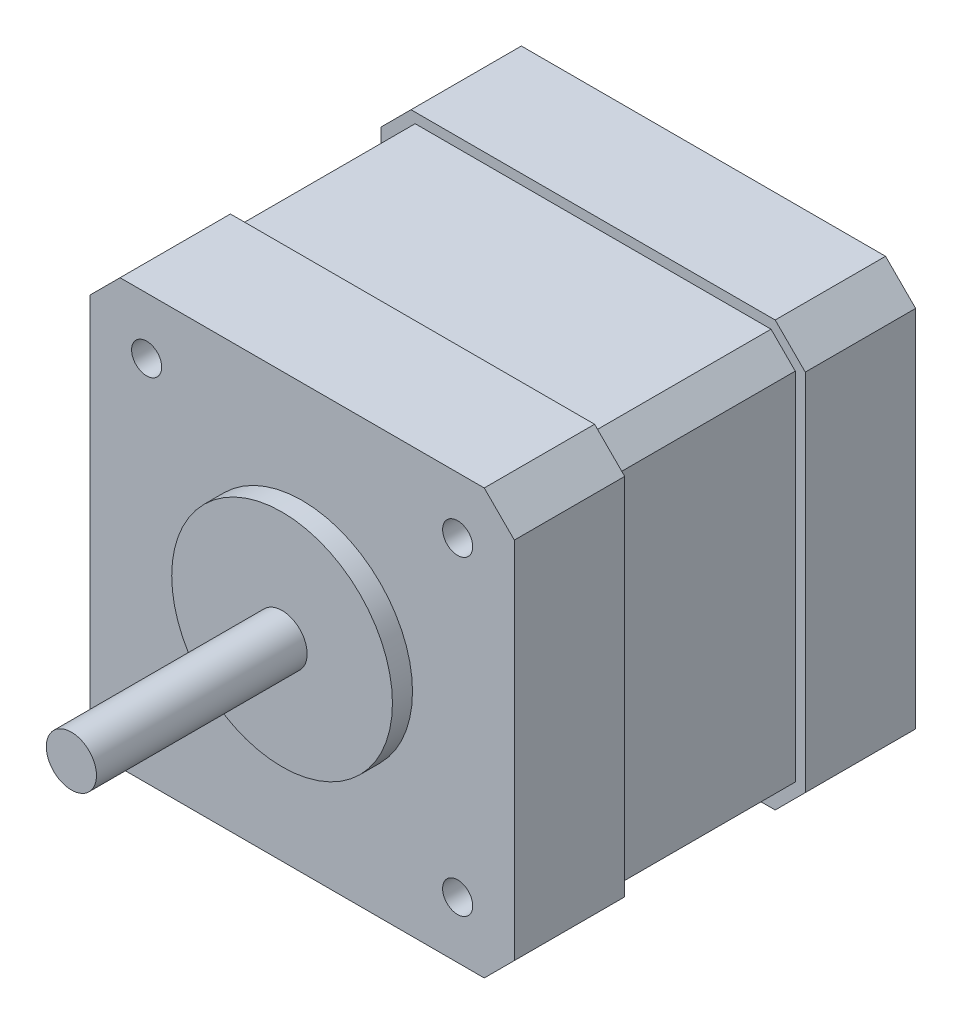
ISO-10303-21;
HEADER;
FILE_DESCRIPTION(('STEP AP214'),'2;1');
FILE_NAME('part.step','',(''),(''),'','','');
FILE_SCHEMA(('AUTOMOTIVE_DESIGN { 1 0 10303 214 1 1 1 1 }'));
ENDSEC;
DATA;
#1=APPLICATION_CONTEXT('core data for automotive mechanical design processes');
#2=APPLICATION_PROTOCOL_DEFINITION('international standard','automotive_design',2000,#1);
#3=PRODUCT_CONTEXT('',#1,'mechanical');
#4=PRODUCT('Part','Part','',(#3));
#5=PRODUCT_RELATED_PRODUCT_CATEGORY('part','',(#4));
#6=PRODUCT_DEFINITION_FORMATION('','',#4);
#7=PRODUCT_DEFINITION_CONTEXT('part definition',#1,'design');
#8=PRODUCT_DEFINITION('design','',#6,#7);
#9=PRODUCT_DEFINITION_SHAPE('','',#8);
#10=(LENGTH_UNIT() NAMED_UNIT(*) SI_UNIT(.MILLI.,.METRE.));
#11=(NAMED_UNIT(*) PLANE_ANGLE_UNIT() SI_UNIT($,.RADIAN.));
#12=(NAMED_UNIT(*) SI_UNIT($,.STERADIAN.) SOLID_ANGLE_UNIT());
#13=UNCERTAINTY_MEASURE_WITH_UNIT(LENGTH_MEASURE(1.E-05),#10,'distance_accuracy_value','');
#14=(GEOMETRIC_REPRESENTATION_CONTEXT(3) GLOBAL_UNCERTAINTY_ASSIGNED_CONTEXT((#13)) GLOBAL_UNIT_ASSIGNED_CONTEXT((#10,
#11,#12)) REPRESENTATION_CONTEXT('',''));
#15=CARTESIAN_POINT('',(0.,0.,0.));
#16=DIRECTION('',(0.,0.,1.));
#17=DIRECTION('',(1.,0.,0.));
#18=AXIS2_PLACEMENT_3D('',#15,#16,#17);
#19=CARTESIAN_POINT('',(-11.6177538051841,1.61380510440835,12.));
#20=DIRECTION('',(0.,0.,-1.));
#21=DIRECTION('',(-1.,0.,0.));
#22=AXIS2_PLACEMENT_3D('',#19,#20,#21);
#23=CYLINDRICAL_SURFACE('',#22,11.);
#24=CARTESIAN_POINT('',(-11.6177538051841,1.61380510440835,11.));
#25=DIRECTION('',(0.,0.,1.));
#26=DIRECTION('',(1.,0.,0.));
#27=AXIS2_PLACEMENT_3D('',#24,#25,#26);
#28=CIRCLE('',#27,11.);
#29=CARTESIAN_POINT('',(-0.617753805184125,1.61380510440835,11.));
#30=VERTEX_POINT('',#29);
#31=EDGE_CURVE('E43',#30,#30,#28,.T.);
#32=ORIENTED_EDGE('',*,*,#31,.T.);
#33=EDGE_LOOP('',(#32));
#34=FACE_BOUND('',#33,.T.);
#35=CARTESIAN_POINT('',(-11.6177538051841,1.61380510440835,13.));
#36=DIRECTION('',(0.,0.,1.));
#37=DIRECTION('',(1.,0.,0.));
#38=AXIS2_PLACEMENT_3D('',#35,#36,#37);
#39=CIRCLE('',#38,11.);
#40=CARTESIAN_POINT('',(-0.617753805184125,1.61380510440835,13.));
#41=VERTEX_POINT('',#40);
#42=EDGE_CURVE('E915',#41,#41,#39,.T.);
#43=ORIENTED_EDGE('',*,*,#42,.F.);
#44=EDGE_LOOP('',(#43));
#45=FACE_BOUND('',#44,.T.);
#46=ADVANCED_FACE('F39',(#34,#45),#23,.T.);
#47=CARTESIAN_POINT('',(0.,0.,11.));
#48=DIRECTION('',(0.,0.,1.));
#49=DIRECTION('',(1.,0.,0.));
#50=AXIS2_PLACEMENT_3D('',#47,#48,#49);
#51=PLANE('',#50);
#52=ORIENTED_EDGE('',*,*,#31,.F.);
#53=EDGE_LOOP('',(#52));
#54=FACE_BOUND('',#53,.T.);
#55=CARTESIAN_POINT('',(-27.1177538051841,-13.8861948955917,11.));
#56=DIRECTION('',(0.,0.,1.));
#57=DIRECTION('',(1.,0.,0.));
#58=AXIS2_PLACEMENT_3D('',#55,#56,#57);
#59=CIRCLE('',#58,1.5);
#60=CARTESIAN_POINT('',(-25.6177538051841,-13.8861948955917,11.));
#61=VERTEX_POINT('',#60);
#62=EDGE_CURVE('E253',#61,#61,#59,.T.);
#63=ORIENTED_EDGE('',*,*,#62,.F.);
#64=EDGE_LOOP('',(#63));
#65=FACE_BOUND('',#64,.T.);
#66=CARTESIAN_POINT('',(3.88224619481587,17.1138051044083,11.));
#67=DIRECTION('',(0.,0.,1.));
#68=DIRECTION('',(1.,0.,0.));
#69=AXIS2_PLACEMENT_3D('',#66,#67,#68);
#70=CIRCLE('',#69,1.5);
#71=CARTESIAN_POINT('',(5.38224619481587,17.1138051044083,11.));
#72=VERTEX_POINT('',#71);
#73=EDGE_CURVE('E259',#72,#72,#70,.T.);
#74=ORIENTED_EDGE('',*,*,#73,.F.);
#75=EDGE_LOOP('',(#74));
#76=FACE_BOUND('',#75,.T.);
#77=DIRECTION('',(-1.,0.,0.));
#78=VECTOR('',#77,1.);
#79=CARTESIAN_POINT('',(6.53224619481587,22.7638051044083,11.));
#80=LINE('',#79,#78);
#81=CARTESIAN_POINT('',(6.53224619481587,22.7638051044083,11.));
#82=VERTEX_POINT('',#81);
#83=CARTESIAN_POINT('',(-29.7677538051841,22.7638051044083,11.));
#84=VERTEX_POINT('',#83);
#85=EDGE_CURVE('E262',#82,#84,#80,.T.);
#86=ORIENTED_EDGE('',*,*,#85,.T.);
#87=DIRECTION('',(-0.707106781186548,-0.707106781186548,0.));
#88=VECTOR('',#87,1.);
#89=CARTESIAN_POINT('',(-29.7677538051841,22.7638051044083,11.));
#90=LINE('',#89,#88);
#91=CARTESIAN_POINT('',(-32.7677538051841,19.7638051044083,11.));
#92=VERTEX_POINT('',#91);
#93=EDGE_CURVE('E265',#84,#92,#90,.T.);
#94=ORIENTED_EDGE('',*,*,#93,.T.);
#95=DIRECTION('',(0.,-1.,0.));
#96=VECTOR('',#95,1.);
#97=CARTESIAN_POINT('',(-32.7677538051841,19.7638051044083,11.));
#98=LINE('',#97,#96);
#99=CARTESIAN_POINT('',(-32.7677538051841,-16.5361948955916,11.));
#100=VERTEX_POINT('',#99);
#101=EDGE_CURVE('E268',#92,#100,#98,.T.);
#102=ORIENTED_EDGE('',*,*,#101,.T.);
#103=DIRECTION('',(0.707106781186548,-0.707106781186548,0.));
#104=VECTOR('',#103,1.);
#105=CARTESIAN_POINT('',(-32.7677538051841,-16.5361948955916,11.));
#106=LINE('',#105,#104);
#107=CARTESIAN_POINT('',(-29.7677538051841,-19.5361948955916,11.));
#108=VERTEX_POINT('',#107);
#109=EDGE_CURVE('E271',#100,#108,#106,.T.);
#110=ORIENTED_EDGE('',*,*,#109,.T.);
#111=DIRECTION('',(1.,0.,0.));
#112=VECTOR('',#111,1.);
#113=CARTESIAN_POINT('',(-29.7677538051841,-19.5361948955916,11.));
#114=LINE('',#113,#112);
#115=CARTESIAN_POINT('',(6.53224619481587,-19.5361948955916,11.));
#116=VERTEX_POINT('',#115);
#117=EDGE_CURVE('E274',#108,#116,#114,.T.);
#118=ORIENTED_EDGE('',*,*,#117,.T.);
#119=DIRECTION('',(0.707106781186548,0.707106781186547,0.));
#120=VECTOR('',#119,1.);
#121=CARTESIAN_POINT('',(6.53224619481587,-19.5361948955916,11.));
#122=LINE('',#121,#120);
#123=CARTESIAN_POINT('',(9.53224619481587,-16.5361948955916,11.));
#124=VERTEX_POINT('',#123);
#125=EDGE_CURVE('E277',#116,#124,#122,.T.);
#126=ORIENTED_EDGE('',*,*,#125,.T.);
#127=DIRECTION('',(0.,1.,0.));
#128=VECTOR('',#127,1.);
#129=CARTESIAN_POINT('',(9.53224619481587,-16.5361948955916,11.));
#130=LINE('',#129,#128);
#131=CARTESIAN_POINT('',(9.53224619481587,19.7638051044083,11.));
#132=VERTEX_POINT('',#131);
#133=EDGE_CURVE('E280',#124,#132,#130,.T.);
#134=ORIENTED_EDGE('',*,*,#133,.T.);
#135=DIRECTION('',(-0.707106781186548,0.707106781186547,0.));
#136=VECTOR('',#135,1.);
#137=CARTESIAN_POINT('',(9.53224619481587,19.7638051044083,11.));
#138=LINE('',#137,#136);
#139=EDGE_CURVE('E283',#132,#82,#138,.T.);
#140=ORIENTED_EDGE('',*,*,#139,.T.);
#141=EDGE_LOOP('',(#86,#94,#102,#110,#118,#126,#134,#140));
#142=FACE_BOUND('',#141,.T.);
#143=CARTESIAN_POINT('',(3.88224619481587,-13.8861948955917,11.));
#144=DIRECTION('',(0.,0.,1.));
#145=DIRECTION('',(1.,0.,0.));
#146=AXIS2_PLACEMENT_3D('',#143,#144,#145);
#147=CIRCLE('',#146,1.5);
#148=CARTESIAN_POINT('',(5.38224619481587,-13.8861948955917,11.));
#149=VERTEX_POINT('',#148);
#150=EDGE_CURVE('E256',#149,#149,#147,.T.);
#151=ORIENTED_EDGE('',*,*,#150,.F.);
#152=EDGE_LOOP('',(#151));
#153=FACE_BOUND('',#152,.T.);
#154=CARTESIAN_POINT('',(-27.1177538051841,17.1138051044083,11.));
#155=DIRECTION('',(0.,0.,1.));
#156=DIRECTION('',(1.,0.,0.));
#157=AXIS2_PLACEMENT_3D('',#154,#155,#156);
#158=CIRCLE('',#157,1.5);
#159=CARTESIAN_POINT('',(-25.6177538051841,17.1138051044083,11.));
#160=VERTEX_POINT('',#159);
#161=EDGE_CURVE('E250',#160,#160,#158,.T.);
#162=ORIENTED_EDGE('',*,*,#161,.F.);
#163=EDGE_LOOP('',(#162));
#164=FACE_BOUND('',#163,.T.);
#165=ADVANCED_FACE('F440',(#54,#65,#76,#142,#153,#164),#51,.T.);
#166=CARTESIAN_POINT('',(8.53224619481587,19.3495915420353,-18.));
#167=DIRECTION('',(-1.,0.,0.));
#168=DIRECTION('',(0.,0.,1.));
#169=AXIS2_PLACEMENT_3D('',#166,#167,#168);
#170=PLANE('',#169);
#171=DIRECTION('',(0.,-1.,0.));
#172=VECTOR('',#171,1.);
#173=CARTESIAN_POINT('',(8.53224619481587,19.3495915420353,0.));
#174=LINE('',#173,#172);
#175=CARTESIAN_POINT('',(8.53224619481587,19.3495915420353,0.));
#176=VERTEX_POINT('',#175);
#177=CARTESIAN_POINT('',(8.53224619481587,-16.1219813332186,0.));
#178=VERTEX_POINT('',#177);
#179=EDGE_CURVE('E351',#176,#178,#174,.T.);
#180=ORIENTED_EDGE('',*,*,#179,.T.);
#181=DIRECTION('',(0.,0.,1.));
#182=VECTOR('',#181,1.);
#183=CARTESIAN_POINT('',(8.53224619481587,-16.1219813332186,-18.));
#184=LINE('',#183,#182);
#185=CARTESIAN_POINT('',(8.53224619481587,-16.1219813332186,-18.));
#186=VERTEX_POINT('',#185);
#187=EDGE_CURVE('E374',#186,#178,#184,.T.);
#188=ORIENTED_EDGE('',*,*,#187,.F.);
#189=DIRECTION('',(0.,-1.,0.));
#190=VECTOR('',#189,1.);
#191=CARTESIAN_POINT('',(8.53224619481587,19.3495915420353,-18.));
#192=LINE('',#191,#190);
#193=CARTESIAN_POINT('',(8.53224619481587,19.3495915420353,-18.));
#194=VERTEX_POINT('',#193);
#195=EDGE_CURVE('E329',#194,#186,#192,.T.);
#196=ORIENTED_EDGE('',*,*,#195,.F.);
#197=DIRECTION('',(0.,0.,1.));
#198=VECTOR('',#197,1.);
#199=CARTESIAN_POINT('',(8.53224619481587,19.3495915420353,-18.));
#200=LINE('',#199,#198);
#201=EDGE_CURVE('E377',#194,#176,#200,.T.);
#202=ORIENTED_EDGE('',*,*,#201,.T.);
#203=EDGE_LOOP('',(#180,#188,#196,#202));
#204=FACE_BOUND('',#203,.T.);
#205=ADVANCED_FACE('F466',(#204),#170,.F.);
#206=CARTESIAN_POINT('',(8.53224619481587,-16.1219813332186,-18.));
#207=DIRECTION('',(-0.707106781186547,0.707106781186547,0.));
#208=DIRECTION('',(-0.707106781186548,-0.707106781186548,0.));
#209=AXIS2_PLACEMENT_3D('',#206,#207,#208);
#210=PLANE('',#209);
#211=DIRECTION('',(-0.707106781186547,-0.707106781186547,0.));
#212=VECTOR('',#211,1.);
#213=CARTESIAN_POINT('',(8.53224619481587,-16.1219813332186,0.));
#214=LINE('',#213,#212);
#215=CARTESIAN_POINT('',(6.11803263244278,-18.5361948955916,0.));
#216=VERTEX_POINT('',#215);
#217=EDGE_CURVE('E353',#178,#216,#214,.T.);
#218=ORIENTED_EDGE('',*,*,#217,.T.);
#219=DIRECTION('',(0.,0.,1.));
#220=VECTOR('',#219,1.);
#221=CARTESIAN_POINT('',(6.11803263244278,-18.5361948955916,-18.));
#222=LINE('',#221,#220);
#223=CARTESIAN_POINT('',(6.11803263244278,-18.5361948955916,-18.));
#224=VERTEX_POINT('',#223);
#225=EDGE_CURVE('E371',#224,#216,#222,.T.);
#226=ORIENTED_EDGE('',*,*,#225,.F.);
#227=DIRECTION('',(-0.707106781186547,-0.707106781186547,0.));
#228=VECTOR('',#227,1.);
#229=CARTESIAN_POINT('',(8.53224619481587,-16.1219813332186,-18.));
#230=LINE('',#229,#228);
#231=EDGE_CURVE('E332',#186,#224,#230,.T.);
#232=ORIENTED_EDGE('',*,*,#231,.F.);
#233=ORIENTED_EDGE('',*,*,#187,.T.);
#234=EDGE_LOOP('',(#218,#226,#232,#233));
#235=FACE_BOUND('',#234,.T.);
#236=ADVANCED_FACE('F730',(#235),#210,.F.);
#237=CARTESIAN_POINT('',(6.11803263244278,-18.5361948955916,-18.));
#238=DIRECTION('',(0.,1.,0.));
#239=DIRECTION('',(-1.,0.,0.));
#240=AXIS2_PLACEMENT_3D('',#237,#238,#239);
#241=PLANE('',#240);
#242=DIRECTION('',(-1.,0.,0.));
#243=VECTOR('',#242,1.);
#244=CARTESIAN_POINT('',(6.11803263244278,-18.5361948955916,0.));
#245=LINE('',#244,#243);
#246=CARTESIAN_POINT('',(-29.353540242811,-18.5361948955917,0.));
#247=VERTEX_POINT('',#246);
#248=EDGE_CURVE('E355',#216,#247,#245,.T.);
#249=ORIENTED_EDGE('',*,*,#248,.T.);
#250=DIRECTION('',(0.,0.,1.));
#251=VECTOR('',#250,1.);
#252=CARTESIAN_POINT('',(-29.353540242811,-18.5361948955917,-18.));
#253=LINE('',#252,#251);
#254=CARTESIAN_POINT('',(-29.353540242811,-18.5361948955917,-18.));
#255=VERTEX_POINT('',#254);
#256=EDGE_CURVE('E368',#255,#247,#253,.T.);
#257=ORIENTED_EDGE('',*,*,#256,.F.);
#258=DIRECTION('',(-1.,0.,0.));
#259=VECTOR('',#258,1.);
#260=CARTESIAN_POINT('',(6.11803263244278,-18.5361948955916,-18.));
#261=LINE('',#260,#259);
#262=EDGE_CURVE('E335',#224,#255,#261,.T.);
#263=ORIENTED_EDGE('',*,*,#262,.F.);
#264=ORIENTED_EDGE('',*,*,#225,.T.);
#265=EDGE_LOOP('',(#249,#257,#263,#264));
#266=FACE_BOUND('',#265,.T.);
#267=ADVANCED_FACE('F740',(#266),#241,.F.);
#268=CARTESIAN_POINT('',(-29.353540242811,-18.5361948955917,-18.));
#269=DIRECTION('',(0.707106781186547,0.707106781186548,0.));
#270=DIRECTION('',(-0.707106781186548,0.707106781186547,0.));
#271=AXIS2_PLACEMENT_3D('',#268,#269,#270);
#272=PLANE('',#271);
#273=DIRECTION('',(-0.707106781186549,0.707106781186547,0.));
#274=VECTOR('',#273,1.);
#275=CARTESIAN_POINT('',(-29.353540242811,-18.5361948955917,0.));
#276=LINE('',#275,#274);
#277=CARTESIAN_POINT('',(-31.7677538051841,-16.1219813332185,0.));
#278=VERTEX_POINT('',#277);
#279=EDGE_CURVE('E357',#247,#278,#276,.T.);
#280=ORIENTED_EDGE('',*,*,#279,.T.);
#281=DIRECTION('',(0.,0.,1.));
#282=VECTOR('',#281,1.);
#283=CARTESIAN_POINT('',(-31.7677538051841,-16.1219813332185,-18.));
#284=LINE('',#283,#282);
#285=CARTESIAN_POINT('',(-31.7677538051841,-16.1219813332185,-18.));
#286=VERTEX_POINT('',#285);
#287=EDGE_CURVE('E365',#286,#278,#284,.T.);
#288=ORIENTED_EDGE('',*,*,#287,.F.);
#289=DIRECTION('',(-0.707106781186549,0.707106781186547,0.));
#290=VECTOR('',#289,1.);
#291=CARTESIAN_POINT('',(-29.353540242811,-18.5361948955917,-18.));
#292=LINE('',#291,#290);
#293=EDGE_CURVE('E338',#255,#286,#292,.T.);
#294=ORIENTED_EDGE('',*,*,#293,.F.);
#295=ORIENTED_EDGE('',*,*,#256,.T.);
#296=EDGE_LOOP('',(#280,#288,#294,#295));
#297=FACE_BOUND('',#296,.T.);
#298=ADVANCED_FACE('F750',(#297),#272,.F.);
#299=CARTESIAN_POINT('',(-31.7677538051841,-16.1219813332185,-18.));
#300=DIRECTION('',(1.,0.,0.));
#301=DIRECTION('',(0.,0.,-1.));
#302=AXIS2_PLACEMENT_3D('',#299,#300,#301);
#303=PLANE('',#302);
#304=DIRECTION('',(0.,1.,0.));
#305=VECTOR('',#304,1.);
#306=CARTESIAN_POINT('',(-31.7677538051841,-16.1219813332185,0.));
#307=LINE('',#306,#305);
#308=CARTESIAN_POINT('',(-31.7677538051841,19.3495915420352,0.));
#309=VERTEX_POINT('',#308);
#310=EDGE_CURVE('E359',#278,#309,#307,.T.);
#311=ORIENTED_EDGE('',*,*,#310,.T.);
#312=DIRECTION('',(0.,0.,1.));
#313=VECTOR('',#312,1.);
#314=CARTESIAN_POINT('',(-31.7677538051841,19.3495915420352,-18.));
#315=LINE('',#314,#313);
#316=CARTESIAN_POINT('',(-31.7677538051841,19.3495915420352,-18.));
#317=VERTEX_POINT('',#316);
#318=EDGE_CURVE('E55',#317,#309,#315,.T.);
#319=ORIENTED_EDGE('',*,*,#318,.F.);
#320=DIRECTION('',(0.,1.,0.));
#321=VECTOR('',#320,1.);
#322=CARTESIAN_POINT('',(-31.7677538051841,-16.1219813332185,-18.));
#323=LINE('',#322,#321);
#324=EDGE_CURVE('E341',#286,#317,#323,.T.);
#325=ORIENTED_EDGE('',*,*,#324,.F.);
#326=ORIENTED_EDGE('',*,*,#287,.T.);
#327=EDGE_LOOP('',(#311,#319,#325,#326));
#328=FACE_BOUND('',#327,.T.);
#329=ADVANCED_FACE('F760',(#328),#303,.F.);
#330=CARTESIAN_POINT('',(-29.353540242811,21.7638051044083,-18.));
#331=DIRECTION('',(0.707106781186547,-0.707106781186547,0.));
#332=DIRECTION('',(0.707106781186548,0.707106781186548,0.));
#333=AXIS2_PLACEMENT_3D('',#330,#331,#332);
#334=PLANE('',#333);
#335=DIRECTION('',(0.707106781186547,0.707106781186547,0.));
#336=VECTOR('',#335,1.);
#337=CARTESIAN_POINT('',(-29.353540242811,21.7638051044083,0.));
#338=LINE('',#337,#336);
#339=CARTESIAN_POINT('',(-29.353540242811,21.7638051044083,0.));
#340=VERTEX_POINT('',#339);
#341=EDGE_CURVE('E326',#309,#340,#338,.T.);
#342=ORIENTED_EDGE('',*,*,#341,.T.);
#343=DIRECTION('',(0.,0.,1.));
#344=VECTOR('',#343,1.);
#345=CARTESIAN_POINT('',(-29.353540242811,21.7638051044083,-18.));
#346=LINE('',#345,#344);
#347=CARTESIAN_POINT('',(-29.353540242811,21.7638051044083,-18.));
#348=VERTEX_POINT('',#347);
#349=EDGE_CURVE('E347',#348,#340,#346,.T.);
#350=ORIENTED_EDGE('',*,*,#349,.F.);
#351=DIRECTION('',(0.707106781186547,0.707106781186547,0.));
#352=VECTOR('',#351,1.);
#353=CARTESIAN_POINT('',(-29.353540242811,21.7638051044083,-18.));
#354=LINE('',#353,#352);
#355=EDGE_CURVE('E344',#317,#348,#354,.T.);
#356=ORIENTED_EDGE('',*,*,#355,.F.);
#357=ORIENTED_EDGE('',*,*,#318,.T.);
#358=EDGE_LOOP('',(#342,#350,#356,#357));
#359=FACE_BOUND('',#358,.T.);
#360=ADVANCED_FACE('F709',(#359),#334,.F.);
#361=CARTESIAN_POINT('',(-11.6177538051841,21.7638051044083,-18.));
#362=DIRECTION('',(0.,-1.,0.));
#363=DIRECTION('',(0.,0.,-1.));
#364=AXIS2_PLACEMENT_3D('',#361,#362,#363);
#365=PLANE('',#364);
#366=DIRECTION('',(1.,0.,0.));
#367=VECTOR('',#366,1.);
#368=CARTESIAN_POINT('',(-11.6177538051841,21.7638051044083,0.));
#369=LINE('',#368,#367);
#370=CARTESIAN_POINT('',(6.11803263244278,21.7638051044083,0.));
#371=VERTEX_POINT('',#370);
#372=EDGE_CURVE('E310',#340,#371,#369,.T.);
#373=ORIENTED_EDGE('',*,*,#372,.T.);
#374=DIRECTION('',(0.,0.,1.));
#375=VECTOR('',#374,1.);
#376=CARTESIAN_POINT('',(6.11803263244278,21.7638051044083,-18.));
#377=LINE('',#376,#375);
#378=CARTESIAN_POINT('',(6.11803263244278,21.7638051044083,-18.));
#379=VERTEX_POINT('',#378);
#380=EDGE_CURVE('E380',#379,#371,#377,.T.);
#381=ORIENTED_EDGE('',*,*,#380,.F.);
#382=DIRECTION('',(1.,0.,0.));
#383=VECTOR('',#382,1.);
#384=CARTESIAN_POINT('',(-11.6177538051841,21.7638051044083,-18.));
#385=LINE('',#384,#383);
#386=EDGE_CURVE('E322',#348,#379,#385,.T.);
#387=ORIENTED_EDGE('',*,*,#386,.F.);
#388=ORIENTED_EDGE('',*,*,#349,.T.);
#389=EDGE_LOOP('',(#373,#381,#387,#388));
#390=FACE_BOUND('',#389,.T.);
#391=ADVANCED_FACE('F704',(#390),#365,.F.);
#392=CARTESIAN_POINT('',(8.53224619481587,19.3495915420353,-18.));
#393=DIRECTION('',(-0.707106781186547,-0.707106781186548,0.));
#394=DIRECTION('',(0.707106781186548,-0.707106781186547,0.));
#395=AXIS2_PLACEMENT_3D('',#392,#393,#394);
#396=PLANE('',#395);
#397=DIRECTION('',(0.707106781186548,-0.707106781186547,0.));
#398=VECTOR('',#397,1.);
#399=CARTESIAN_POINT('',(8.53224619481587,19.3495915420353,0.));
#400=LINE('',#399,#398);
#401=EDGE_CURVE('E349',#371,#176,#400,.T.);
#402=ORIENTED_EDGE('',*,*,#401,.T.);
#403=ORIENTED_EDGE('',*,*,#201,.F.);
#404=DIRECTION('',(0.707106781186548,-0.707106781186547,0.));
#405=VECTOR('',#404,1.);
#406=CARTESIAN_POINT('',(8.53224619481587,19.3495915420353,-18.));
#407=LINE('',#406,#405);
#408=EDGE_CURVE('E325',#379,#194,#407,.T.);
#409=ORIENTED_EDGE('',*,*,#408,.F.);
#410=ORIENTED_EDGE('',*,*,#380,.T.);
#411=EDGE_LOOP('',(#402,#403,#409,#410));
#412=FACE_BOUND('',#411,.T.);
#413=ADVANCED_FACE('F477',(#412),#396,.F.);
#414=CARTESIAN_POINT('',(0.,0.,0.));
#415=DIRECTION('',(0.,0.,-1.));
#416=DIRECTION('',(-1.,0.,0.));
#417=AXIS2_PLACEMENT_3D('',#414,#415,#416);
#418=PLANE('',#417);
#419=DIRECTION('',(-0.707106781186548,-0.707106781186548,0.));
#420=VECTOR('',#419,1.);
#421=CARTESIAN_POINT('',(-32.7677538051841,19.7638051044083,0.));
#422=LINE('',#421,#420);
#423=CARTESIAN_POINT('',(-29.7677538051841,22.7638051044083,0.));
#424=VERTEX_POINT('',#423);
#425=CARTESIAN_POINT('',(-32.7677538051841,19.7638051044083,0.));
#426=VERTEX_POINT('',#425);
#427=EDGE_CURVE('E386',#424,#426,#422,.T.);
#428=ORIENTED_EDGE('',*,*,#427,.F.);
#429=DIRECTION('',(-1.,0.,0.));
#430=VECTOR('',#429,1.);
#431=CARTESIAN_POINT('',(-29.7677538051841,22.7638051044083,0.));
#432=LINE('',#431,#430);
#433=CARTESIAN_POINT('',(6.53224619481587,22.7638051044083,0.));
#434=VERTEX_POINT('',#433);
#435=EDGE_CURVE('E63',#434,#424,#432,.T.);
#436=ORIENTED_EDGE('',*,*,#435,.F.);
#437=DIRECTION('',(-0.707106781186548,0.707106781186547,0.));
#438=VECTOR('',#437,1.);
#439=CARTESIAN_POINT('',(6.53224619481587,22.7638051044083,0.));
#440=LINE('',#439,#438);
#441=CARTESIAN_POINT('',(9.53224619481587,19.7638051044083,0.));
#442=VERTEX_POINT('',#441);
#443=EDGE_CURVE('E399',#442,#434,#440,.T.);
#444=ORIENTED_EDGE('',*,*,#443,.F.);
#445=DIRECTION('',(0.,1.,0.));
#446=VECTOR('',#445,1.);
#447=CARTESIAN_POINT('',(9.53224619481587,19.7638051044083,0.));
#448=LINE('',#447,#446);
#449=CARTESIAN_POINT('',(9.53224619481587,-16.5361948955916,0.));
#450=VERTEX_POINT('',#449);
#451=EDGE_CURVE('E397',#450,#442,#448,.T.);
#452=ORIENTED_EDGE('',*,*,#451,.F.);
#453=DIRECTION('',(0.707106781186548,0.707106781186547,0.));
#454=VECTOR('',#453,1.);
#455=CARTESIAN_POINT('',(9.53224619481587,-16.5361948955916,0.));
#456=LINE('',#455,#454);
#457=CARTESIAN_POINT('',(6.53224619481587,-19.5361948955916,0.));
#458=VERTEX_POINT('',#457);
#459=EDGE_CURVE('E395',#458,#450,#456,.T.);
#460=ORIENTED_EDGE('',*,*,#459,.F.);
#461=DIRECTION('',(1.,0.,0.));
#462=VECTOR('',#461,1.);
#463=CARTESIAN_POINT('',(6.53224619481587,-19.5361948955916,0.));
#464=LINE('',#463,#462);
#465=CARTESIAN_POINT('',(-29.7677538051841,-19.5361948955916,0.));
#466=VERTEX_POINT('',#465);
#467=EDGE_CURVE('E393',#466,#458,#464,.T.);
#468=ORIENTED_EDGE('',*,*,#467,.F.);
#469=DIRECTION('',(0.707106781186548,-0.707106781186548,0.));
#470=VECTOR('',#469,1.);
#471=CARTESIAN_POINT('',(-29.7677538051841,-19.5361948955916,0.));
#472=LINE('',#471,#470);
#473=CARTESIAN_POINT('',(-32.7677538051841,-16.5361948955916,0.));
#474=VERTEX_POINT('',#473);
#475=EDGE_CURVE('E391',#474,#466,#472,.T.);
#476=ORIENTED_EDGE('',*,*,#475,.F.);
#477=DIRECTION('',(0.,-1.,0.));
#478=VECTOR('',#477,1.);
#479=CARTESIAN_POINT('',(-32.7677538051841,-16.5361948955916,0.));
#480=LINE('',#479,#478);
#481=EDGE_CURVE('E389',#426,#474,#480,.T.);
#482=ORIENTED_EDGE('',*,*,#481,.F.);
#483=EDGE_LOOP('',(#428,#436,#444,#452,#460,#468,#476,#482));
#484=FACE_BOUND('',#483,.T.);
#485=ORIENTED_EDGE('',*,*,#401,.F.);
#486=ORIENTED_EDGE('',*,*,#372,.F.);
#487=ORIENTED_EDGE('',*,*,#341,.F.);
#488=ORIENTED_EDGE('',*,*,#310,.F.);
#489=ORIENTED_EDGE('',*,*,#279,.F.);
#490=ORIENTED_EDGE('',*,*,#248,.F.);
#491=ORIENTED_EDGE('',*,*,#217,.F.);
#492=ORIENTED_EDGE('',*,*,#179,.F.);
#493=EDGE_LOOP('',(#485,#486,#487,#488,#489,#490,#491,#492));
#494=FACE_BOUND('',#493,.T.);
#495=ADVANCED_FACE('F428',(#484,#494),#418,.T.);
#496=CARTESIAN_POINT('',(-29.7677538051841,22.7638051044083,10.));
#497=DIRECTION('',(0.,-1.,0.));
#498=DIRECTION('',(0.,0.,-1.));
#499=AXIS2_PLACEMENT_3D('',#496,#497,#498);
#500=PLANE('',#499);
#501=ORIENTED_EDGE('',*,*,#435,.T.);
#502=DIRECTION('',(0.,0.,-1.));
#503=VECTOR('',#502,1.);
#504=CARTESIAN_POINT('',(-29.7677538051841,22.7638051044083,10.));
#505=LINE('',#504,#503);
#506=EDGE_CURVE('E402',#84,#424,#505,.T.);
#507=ORIENTED_EDGE('',*,*,#506,.F.);
#508=ORIENTED_EDGE('',*,*,#85,.F.);
#509=DIRECTION('',(0.,0.,-1.));
#510=VECTOR('',#509,1.);
#511=CARTESIAN_POINT('',(6.53224619481587,22.7638051044083,10.));
#512=LINE('',#511,#510);
#513=EDGE_CURVE('E404',#82,#434,#512,.T.);
#514=ORIENTED_EDGE('',*,*,#513,.T.);
#515=EDGE_LOOP('',(#501,#507,#508,#514));
#516=FACE_BOUND('',#515,.T.);
#517=ADVANCED_FACE('F451',(#516),#500,.F.);
#518=CARTESIAN_POINT('',(6.53224619481587,22.7638051044083,10.));
#519=DIRECTION('',(-0.707106781186547,-0.707106781186548,0.));
#520=DIRECTION('',(0.707106781186548,-0.707106781186547,0.));
#521=AXIS2_PLACEMENT_3D('',#518,#519,#520);
#522=PLANE('',#521);
#523=ORIENTED_EDGE('',*,*,#443,.T.);
#524=ORIENTED_EDGE('',*,*,#513,.F.);
#525=ORIENTED_EDGE('',*,*,#139,.F.);
#526=DIRECTION('',(0.,0.,-1.));
#527=VECTOR('',#526,1.);
#528=CARTESIAN_POINT('',(9.53224619481587,19.7638051044083,10.));
#529=LINE('',#528,#527);
#530=EDGE_CURVE('E406',#132,#442,#529,.T.);
#531=ORIENTED_EDGE('',*,*,#530,.T.);
#532=EDGE_LOOP('',(#523,#524,#525,#531));
#533=FACE_BOUND('',#532,.T.);
#534=ADVANCED_FACE('F447',(#533),#522,.F.);
#535=CARTESIAN_POINT('',(9.53224619481587,19.7638051044083,10.));
#536=DIRECTION('',(-1.,0.,0.));
#537=DIRECTION('',(0.,0.,1.));
#538=AXIS2_PLACEMENT_3D('',#535,#536,#537);
#539=PLANE('',#538);
#540=ORIENTED_EDGE('',*,*,#451,.T.);
#541=ORIENTED_EDGE('',*,*,#530,.F.);
#542=ORIENTED_EDGE('',*,*,#133,.F.);
#543=DIRECTION('',(0.,0.,-1.));
#544=VECTOR('',#543,1.);
#545=CARTESIAN_POINT('',(9.53224619481587,-16.5361948955916,10.));
#546=LINE('',#545,#544);
#547=EDGE_CURVE('E409',#124,#450,#546,.T.);
#548=ORIENTED_EDGE('',*,*,#547,.T.);
#549=EDGE_LOOP('',(#540,#541,#542,#548));
#550=FACE_BOUND('',#549,.T.);
#551=ADVANCED_FACE('F444',(#550),#539,.F.);
#552=CARTESIAN_POINT('',(9.53224619481587,-16.5361948955916,10.));
#553=DIRECTION('',(-0.707106781186547,0.707106781186548,0.));
#554=DIRECTION('',(-0.707106781186548,-0.707106781186547,0.));
#555=AXIS2_PLACEMENT_3D('',#552,#553,#554);
#556=PLANE('',#555);
#557=ORIENTED_EDGE('',*,*,#459,.T.);
#558=ORIENTED_EDGE('',*,*,#547,.F.);
#559=ORIENTED_EDGE('',*,*,#125,.F.);
#560=DIRECTION('',(0.,0.,-1.));
#561=VECTOR('',#560,1.);
#562=CARTESIAN_POINT('',(6.53224619481587,-19.5361948955916,10.));
#563=LINE('',#562,#561);
#564=EDGE_CURVE('E412',#116,#458,#563,.T.);
#565=ORIENTED_EDGE('',*,*,#564,.T.);
#566=EDGE_LOOP('',(#557,#558,#559,#565));
#567=FACE_BOUND('',#566,.T.);
#568=ADVANCED_FACE('F437',(#567),#556,.F.);
#569=CARTESIAN_POINT('',(6.53224619481587,-19.5361948955916,10.));
#570=DIRECTION('',(0.,1.,0.));
#571=DIRECTION('',(0.,0.,1.));
#572=AXIS2_PLACEMENT_3D('',#569,#570,#571);
#573=PLANE('',#572);
#574=ORIENTED_EDGE('',*,*,#467,.T.);
#575=ORIENTED_EDGE('',*,*,#564,.F.);
#576=ORIENTED_EDGE('',*,*,#117,.F.);
#577=DIRECTION('',(0.,0.,-1.));
#578=VECTOR('',#577,1.);
#579=CARTESIAN_POINT('',(-29.7677538051841,-19.5361948955916,10.));
#580=LINE('',#579,#578);
#581=EDGE_CURVE('E415',#108,#466,#580,.T.);
#582=ORIENTED_EDGE('',*,*,#581,.T.);
#583=EDGE_LOOP('',(#574,#575,#576,#582));
#584=FACE_BOUND('',#583,.T.);
#585=ADVANCED_FACE('F433',(#584),#573,.F.);
#586=CARTESIAN_POINT('',(-29.7677538051841,-19.5361948955916,10.));
#587=DIRECTION('',(0.707106781186548,0.707106781186548,0.));
#588=DIRECTION('',(-0.707106781186548,0.707106781186548,0.));
#589=AXIS2_PLACEMENT_3D('',#586,#587,#588);
#590=PLANE('',#589);
#591=ORIENTED_EDGE('',*,*,#475,.T.);
#592=ORIENTED_EDGE('',*,*,#581,.F.);
#593=ORIENTED_EDGE('',*,*,#109,.F.);
#594=DIRECTION('',(0.,0.,-1.));
#595=VECTOR('',#594,1.);
#596=CARTESIAN_POINT('',(-32.7677538051841,-16.5361948955916,10.));
#597=LINE('',#596,#595);
#598=EDGE_CURVE('E48',#100,#474,#597,.T.);
#599=ORIENTED_EDGE('',*,*,#598,.T.);
#600=EDGE_LOOP('',(#591,#592,#593,#599));
#601=FACE_BOUND('',#600,.T.);
#602=ADVANCED_FACE('F422',(#601),#590,.F.);
#603=CARTESIAN_POINT('',(-32.7677538051841,-16.5361948955916,10.));
#604=DIRECTION('',(1.,0.,0.));
#605=DIRECTION('',(0.,0.,-1.));
#606=AXIS2_PLACEMENT_3D('',#603,#604,#605);
#607=PLANE('',#606);
#608=ORIENTED_EDGE('',*,*,#481,.T.);
#609=ORIENTED_EDGE('',*,*,#598,.F.);
#610=ORIENTED_EDGE('',*,*,#101,.F.);
#611=DIRECTION('',(0.,0.,-1.));
#612=VECTOR('',#611,1.);
#613=CARTESIAN_POINT('',(-32.7677538051841,19.7638051044083,10.));
#614=LINE('',#613,#612);
#615=EDGE_CURVE('E11',#92,#426,#614,.T.);
#616=ORIENTED_EDGE('',*,*,#615,.T.);
#617=EDGE_LOOP('',(#608,#609,#610,#616));
#618=FACE_BOUND('',#617,.T.);
#619=ADVANCED_FACE('F452',(#618),#607,.F.);
#620=CARTESIAN_POINT('',(-32.7677538051841,19.7638051044083,10.));
#621=DIRECTION('',(0.707106781186548,-0.707106781186548,0.));
#622=DIRECTION('',(0.707106781186548,0.707106781186548,0.));
#623=AXIS2_PLACEMENT_3D('',#620,#621,#622);
#624=PLANE('',#623);
#625=ORIENTED_EDGE('',*,*,#427,.T.);
#626=ORIENTED_EDGE('',*,*,#615,.F.);
#627=ORIENTED_EDGE('',*,*,#93,.F.);
#628=ORIENTED_EDGE('',*,*,#506,.T.);
#629=EDGE_LOOP('',(#625,#626,#627,#628));
#630=FACE_BOUND('',#629,.T.);
#631=ADVANCED_FACE('F41',(#630),#624,.F.);
#632=CARTESIAN_POINT('',(0.,0.,-18.));
#633=DIRECTION('',(0.,0.,-1.));
#634=DIRECTION('',(-1.,0.,0.));
#635=AXIS2_PLACEMENT_3D('',#632,#633,#634);
#636=PLANE('',#635);
#637=DIRECTION('',(-0.707106781186548,-0.707106781186548,0.));
#638=VECTOR('',#637,1.);
#639=CARTESIAN_POINT('',(-32.7677538051841,19.7638051044083,-18.));
#640=LINE('',#639,#638);
#641=CARTESIAN_POINT('',(-29.7677538051841,22.7638051044083,-18.));
#642=VERTEX_POINT('',#641);
#643=CARTESIAN_POINT('',(-32.7677538051841,19.7638051044083,-18.));
#644=VERTEX_POINT('',#643);
#645=EDGE_CURVE('E289',#642,#644,#640,.T.);
#646=ORIENTED_EDGE('',*,*,#645,.T.);
#647=DIRECTION('',(0.,-1.,0.));
#648=VECTOR('',#647,1.);
#649=CARTESIAN_POINT('',(-32.7677538051841,-16.5361948955916,-18.));
#650=LINE('',#649,#648);
#651=CARTESIAN_POINT('',(-32.7677538051841,-16.5361948955916,-18.));
#652=VERTEX_POINT('',#651);
#653=EDGE_CURVE('E208',#644,#652,#650,.T.);
#654=ORIENTED_EDGE('',*,*,#653,.T.);
#655=DIRECTION('',(0.707106781186548,-0.707106781186548,0.));
#656=VECTOR('',#655,1.);
#657=CARTESIAN_POINT('',(-29.7677538051841,-19.5361948955916,-18.));
#658=LINE('',#657,#656);
#659=CARTESIAN_POINT('',(-29.7677538051841,-19.5361948955916,-18.));
#660=VERTEX_POINT('',#659);
#661=EDGE_CURVE('E292',#652,#660,#658,.T.);
#662=ORIENTED_EDGE('',*,*,#661,.T.);
#663=DIRECTION('',(1.,0.,0.));
#664=VECTOR('',#663,1.);
#665=CARTESIAN_POINT('',(6.53224619481587,-19.5361948955916,-18.));
#666=LINE('',#665,#664);
#667=CARTESIAN_POINT('',(6.53224619481587,-19.5361948955916,-18.));
#668=VERTEX_POINT('',#667);
#669=EDGE_CURVE('E295',#660,#668,#666,.T.);
#670=ORIENTED_EDGE('',*,*,#669,.T.);
#671=DIRECTION('',(0.707106781186548,0.707106781186547,0.));
#672=VECTOR('',#671,1.);
#673=CARTESIAN_POINT('',(9.53224619481587,-16.5361948955916,-18.));
#674=LINE('',#673,#672);
#675=CARTESIAN_POINT('',(9.53224619481587,-16.5361948955916,-18.));
#676=VERTEX_POINT('',#675);
#677=EDGE_CURVE('E298',#668,#676,#674,.T.);
#678=ORIENTED_EDGE('',*,*,#677,.T.);
#679=DIRECTION('',(0.,1.,0.));
#680=VECTOR('',#679,1.);
#681=CARTESIAN_POINT('',(9.53224619481587,19.7638051044083,-18.));
#682=LINE('',#681,#680);
#683=CARTESIAN_POINT('',(9.53224619481587,19.7638051044083,-18.));
#684=VERTEX_POINT('',#683);
#685=EDGE_CURVE('E301',#676,#684,#682,.T.);
#686=ORIENTED_EDGE('',*,*,#685,.T.);
#687=DIRECTION('',(-0.707106781186548,0.707106781186547,0.));
#688=VECTOR('',#687,1.);
#689=CARTESIAN_POINT('',(6.53224619481587,22.7638051044083,-18.));
#690=LINE('',#689,#688);
#691=CARTESIAN_POINT('',(6.53224619481587,22.7638051044083,-18.));
#692=VERTEX_POINT('',#691);
#693=EDGE_CURVE('E304',#684,#692,#690,.T.);
#694=ORIENTED_EDGE('',*,*,#693,.T.);
#695=DIRECTION('',(-1.,0.,0.));
#696=VECTOR('',#695,1.);
#697=CARTESIAN_POINT('',(-29.7677538051841,22.7638051044083,-18.));
#698=LINE('',#697,#696);
#699=EDGE_CURVE('E213',#692,#642,#698,.T.);
#700=ORIENTED_EDGE('',*,*,#699,.T.);
#701=EDGE_LOOP('',(#646,#654,#662,#670,#678,#686,#694,#700));
#702=FACE_BOUND('',#701,.T.);
#703=ORIENTED_EDGE('',*,*,#355,.T.);
#704=ORIENTED_EDGE('',*,*,#386,.T.);
#705=ORIENTED_EDGE('',*,*,#408,.T.);
#706=ORIENTED_EDGE('',*,*,#195,.T.);
#707=ORIENTED_EDGE('',*,*,#231,.T.);
#708=ORIENTED_EDGE('',*,*,#262,.T.);
#709=ORIENTED_EDGE('',*,*,#293,.T.);
#710=ORIENTED_EDGE('',*,*,#324,.T.);
#711=EDGE_LOOP('',(#703,#704,#705,#706,#707,#708,#709,#710));
#712=FACE_BOUND('',#711,.T.);
#713=ADVANCED_FACE('F458',(#702,#712),#636,.F.);
#714=CARTESIAN_POINT('',(-32.7677538051841,-16.5361948955916,-28.));
#715=DIRECTION('',(-1.,0.,0.));
#716=DIRECTION('',(0.,0.,1.));
#717=AXIS2_PLACEMENT_3D('',#714,#715,#716);
#718=PLANE('',#717);
#719=ORIENTED_EDGE('',*,*,#653,.F.);
#720=DIRECTION('',(0.,0.,1.));
#721=VECTOR('',#720,1.);
#722=CARTESIAN_POINT('',(-32.7677538051841,19.7638051044083,-28.));
#723=LINE('',#722,#721);
#724=CARTESIAN_POINT('',(-32.7677538051841,19.7638051044083,-29.));
#725=VERTEX_POINT('',#724);
#726=EDGE_CURVE('E202',#725,#644,#723,.T.);
#727=ORIENTED_EDGE('',*,*,#726,.F.);
#728=DIRECTION('',(0.,1.,0.));
#729=VECTOR('',#728,1.);
#730=CARTESIAN_POINT('',(-32.7677538051841,-16.5361948955916,-29.));
#731=LINE('',#730,#729);
#732=CARTESIAN_POINT('',(-32.7677538051841,-16.5361948955916,-29.));
#733=VERTEX_POINT('',#732);
#734=EDGE_CURVE('E206',#733,#725,#731,.T.);
#735=ORIENTED_EDGE('',*,*,#734,.F.);
#736=DIRECTION('',(0.,0.,1.));
#737=VECTOR('',#736,1.);
#738=CARTESIAN_POINT('',(-32.7677538051841,-16.5361948955916,-28.));
#739=LINE('',#738,#737);
#740=EDGE_CURVE('E212',#733,#652,#739,.T.);
#741=ORIENTED_EDGE('',*,*,#740,.T.);
#742=EDGE_LOOP('',(#719,#727,#735,#741));
#743=FACE_BOUND('',#742,.T.);
#744=ADVANCED_FACE('F204',(#743),#718,.T.);
#745=CARTESIAN_POINT('',(-29.7677538051841,-19.5361948955916,-28.));
#746=DIRECTION('',(-0.707106781186548,-0.707106781186548,0.));
#747=DIRECTION('',(0.707106781186548,-0.707106781186548,0.));
#748=AXIS2_PLACEMENT_3D('',#745,#746,#747);
#749=PLANE('',#748);
#750=ORIENTED_EDGE('',*,*,#661,.F.);
#751=ORIENTED_EDGE('',*,*,#740,.F.);
#752=DIRECTION('',(-0.707106781186548,0.707106781186548,0.));
#753=VECTOR('',#752,1.);
#754=CARTESIAN_POINT('',(-29.7677538051841,-19.5361948955916,-29.));
#755=LINE('',#754,#753);
#756=CARTESIAN_POINT('',(-29.7677538051841,-19.5361948955916,-29.));
#757=VERTEX_POINT('',#756);
#758=EDGE_CURVE('E229',#757,#733,#755,.T.);
#759=ORIENTED_EDGE('',*,*,#758,.F.);
#760=DIRECTION('',(0.,0.,1.));
#761=VECTOR('',#760,1.);
#762=CARTESIAN_POINT('',(-29.7677538051841,-19.5361948955916,-28.));
#763=LINE('',#762,#761);
#764=EDGE_CURVE('E319',#757,#660,#763,.T.);
#765=ORIENTED_EDGE('',*,*,#764,.T.);
#766=EDGE_LOOP('',(#750,#751,#759,#765));
#767=FACE_BOUND('',#766,.T.);
#768=ADVANCED_FACE('F519',(#767),#749,.T.);
#769=CARTESIAN_POINT('',(6.53224619481587,-19.5361948955916,-28.));
#770=DIRECTION('',(0.,-1.,0.));
#771=DIRECTION('',(0.,0.,-1.));
#772=AXIS2_PLACEMENT_3D('',#769,#770,#771);
#773=PLANE('',#772);
#774=ORIENTED_EDGE('',*,*,#669,.F.);
#775=ORIENTED_EDGE('',*,*,#764,.F.);
#776=DIRECTION('',(-1.,0.,0.));
#777=VECTOR('',#776,1.);
#778=CARTESIAN_POINT('',(6.53224619481587,-19.5361948955916,-29.));
#779=LINE('',#778,#777);
#780=CARTESIAN_POINT('',(6.53224619481587,-19.5361948955916,-29.));
#781=VERTEX_POINT('',#780);
#782=EDGE_CURVE('E247',#781,#757,#779,.T.);
#783=ORIENTED_EDGE('',*,*,#782,.F.);
#784=DIRECTION('',(0.,0.,1.));
#785=VECTOR('',#784,1.);
#786=CARTESIAN_POINT('',(6.53224619481587,-19.5361948955916,-28.));
#787=LINE('',#786,#785);
#788=EDGE_CURVE('E317',#781,#668,#787,.T.);
#789=ORIENTED_EDGE('',*,*,#788,.T.);
#790=EDGE_LOOP('',(#774,#775,#783,#789));
#791=FACE_BOUND('',#790,.T.);
#792=ADVANCED_FACE('F530',(#791),#773,.T.);
#793=CARTESIAN_POINT('',(9.53224619481587,-16.5361948955916,-28.));
#794=DIRECTION('',(0.707106781186547,-0.707106781186548,0.));
#795=DIRECTION('',(0.707106781186548,0.707106781186547,0.));
#796=AXIS2_PLACEMENT_3D('',#793,#794,#795);
#797=PLANE('',#796);
#798=ORIENTED_EDGE('',*,*,#677,.F.);
#799=ORIENTED_EDGE('',*,*,#788,.F.);
#800=DIRECTION('',(-0.707106781186548,-0.707106781186547,0.));
#801=VECTOR('',#800,1.);
#802=CARTESIAN_POINT('',(9.53224619481587,-16.5361948955916,-29.));
#803=LINE('',#802,#801);
#804=CARTESIAN_POINT('',(9.53224619481587,-16.5361948955916,-29.));
#805=VERTEX_POINT('',#804);
#806=EDGE_CURVE('E244',#805,#781,#803,.T.);
#807=ORIENTED_EDGE('',*,*,#806,.F.);
#808=DIRECTION('',(0.,0.,1.));
#809=VECTOR('',#808,1.);
#810=CARTESIAN_POINT('',(9.53224619481587,-16.5361948955916,-28.));
#811=LINE('',#810,#809);
#812=EDGE_CURVE('E315',#805,#676,#811,.T.);
#813=ORIENTED_EDGE('',*,*,#812,.T.);
#814=EDGE_LOOP('',(#798,#799,#807,#813));
#815=FACE_BOUND('',#814,.T.);
#816=ADVANCED_FACE('F541',(#815),#797,.T.);
#817=CARTESIAN_POINT('',(9.53224619481587,19.7638051044083,-28.));
#818=DIRECTION('',(1.,0.,0.));
#819=DIRECTION('',(0.,0.,-1.));
#820=AXIS2_PLACEMENT_3D('',#817,#818,#819);
#821=PLANE('',#820);
#822=ORIENTED_EDGE('',*,*,#685,.F.);
#823=ORIENTED_EDGE('',*,*,#812,.F.);
#824=DIRECTION('',(0.,-1.,0.));
#825=VECTOR('',#824,1.);
#826=CARTESIAN_POINT('',(9.53224619481587,19.7638051044083,-29.));
#827=LINE('',#826,#825);
#828=CARTESIAN_POINT('',(9.53224619481587,19.7638051044083,-29.));
#829=VERTEX_POINT('',#828);
#830=EDGE_CURVE('E241',#829,#805,#827,.T.);
#831=ORIENTED_EDGE('',*,*,#830,.F.);
#832=DIRECTION('',(0.,0.,1.));
#833=VECTOR('',#832,1.);
#834=CARTESIAN_POINT('',(9.53224619481587,19.7638051044083,-28.));
#835=LINE('',#834,#833);
#836=EDGE_CURVE('E313',#829,#684,#835,.T.);
#837=ORIENTED_EDGE('',*,*,#836,.T.);
#838=EDGE_LOOP('',(#822,#823,#831,#837));
#839=FACE_BOUND('',#838,.T.);
#840=ADVANCED_FACE('F552',(#839),#821,.T.);
#841=CARTESIAN_POINT('',(6.53224619481587,22.7638051044083,-28.));
#842=DIRECTION('',(0.707106781186547,0.707106781186548,0.));
#843=DIRECTION('',(-0.707106781186548,0.707106781186547,0.));
#844=AXIS2_PLACEMENT_3D('',#841,#842,#843);
#845=PLANE('',#844);
#846=ORIENTED_EDGE('',*,*,#693,.F.);
#847=ORIENTED_EDGE('',*,*,#836,.F.);
#848=DIRECTION('',(0.707106781186548,-0.707106781186547,0.));
#849=VECTOR('',#848,1.);
#850=CARTESIAN_POINT('',(6.53224619481587,22.7638051044083,-29.));
#851=LINE('',#850,#849);
#852=CARTESIAN_POINT('',(6.53224619481587,22.7638051044083,-29.));
#853=VERTEX_POINT('',#852);
#854=EDGE_CURVE('E238',#853,#829,#851,.T.);
#855=ORIENTED_EDGE('',*,*,#854,.F.);
#856=DIRECTION('',(0.,0.,1.));
#857=VECTOR('',#856,1.);
#858=CARTESIAN_POINT('',(6.53224619481587,22.7638051044083,-28.));
#859=LINE('',#858,#857);
#860=EDGE_CURVE('E311',#853,#692,#859,.T.);
#861=ORIENTED_EDGE('',*,*,#860,.T.);
#862=EDGE_LOOP('',(#846,#847,#855,#861));
#863=FACE_BOUND('',#862,.T.);
#864=ADVANCED_FACE('F563',(#863),#845,.T.);
#865=CARTESIAN_POINT('',(-29.7677538051841,22.7638051044083,-28.));
#866=DIRECTION('',(0.,1.,0.));
#867=DIRECTION('',(0.,0.,1.));
#868=AXIS2_PLACEMENT_3D('',#865,#866,#867);
#869=PLANE('',#868);
#870=ORIENTED_EDGE('',*,*,#699,.F.);
#871=ORIENTED_EDGE('',*,*,#860,.F.);
#872=DIRECTION('',(1.,0.,0.));
#873=VECTOR('',#872,1.);
#874=CARTESIAN_POINT('',(-29.7677538051841,22.7638051044083,-29.));
#875=LINE('',#874,#873);
#876=CARTESIAN_POINT('',(-29.7677538051841,22.7638051044083,-29.));
#877=VERTEX_POINT('',#876);
#878=EDGE_CURVE('E222',#877,#853,#875,.T.);
#879=ORIENTED_EDGE('',*,*,#878,.F.);
#880=DIRECTION('',(0.,0.,1.));
#881=VECTOR('',#880,1.);
#882=CARTESIAN_POINT('',(-29.7677538051841,22.7638051044083,-28.));
#883=LINE('',#882,#881);
#884=EDGE_CURVE('E218',#877,#642,#883,.T.);
#885=ORIENTED_EDGE('',*,*,#884,.T.);
#886=EDGE_LOOP('',(#870,#871,#879,#885));
#887=FACE_BOUND('',#886,.T.);
#888=ADVANCED_FACE('F574',(#887),#869,.T.);
#889=CARTESIAN_POINT('',(-32.7677538051841,19.7638051044083,-28.));
#890=DIRECTION('',(-0.707106781186548,0.707106781186548,0.));
#891=DIRECTION('',(-0.707106781186548,-0.707106781186548,0.));
#892=AXIS2_PLACEMENT_3D('',#889,#890,#891);
#893=PLANE('',#892);
#894=ORIENTED_EDGE('',*,*,#645,.F.);
#895=ORIENTED_EDGE('',*,*,#884,.F.);
#896=DIRECTION('',(0.707106781186548,0.707106781186548,0.));
#897=VECTOR('',#896,1.);
#898=CARTESIAN_POINT('',(-32.7677538051841,19.7638051044083,-29.));
#899=LINE('',#898,#897);
#900=EDGE_CURVE('E216',#725,#877,#899,.T.);
#901=ORIENTED_EDGE('',*,*,#900,.F.);
#902=ORIENTED_EDGE('',*,*,#726,.T.);
#903=EDGE_LOOP('',(#894,#895,#901,#902));
#904=FACE_BOUND('',#903,.T.);
#905=ADVANCED_FACE('F217',(#904),#893,.T.);
#906=CARTESIAN_POINT('',(-27.1177538051841,17.1138051044083,-36.5));
#907=DIRECTION('',(0.,0.,1.));
#908=DIRECTION('',(1.,0.,0.));
#909=AXIS2_PLACEMENT_3D('',#906,#907,#908);
#910=CYLINDRICAL_SURFACE('',#909,1.5);
#911=ORIENTED_EDGE('',*,*,#161,.T.);
#912=EDGE_LOOP('',(#911));
#913=FACE_BOUND('',#912,.T.);
#914=CARTESIAN_POINT('',(-27.1177538051841,17.1138051044083,-29.));
#915=DIRECTION('',(0.,0.,-1.));
#916=DIRECTION('',(-1.,0.,0.));
#917=AXIS2_PLACEMENT_3D('',#914,#915,#916);
#918=CIRCLE('',#917,1.5);
#919=CARTESIAN_POINT('',(-28.6177538051841,17.1138051044083,-29.));
#920=VERTEX_POINT('',#919);
#921=EDGE_CURVE('E910',#920,#920,#918,.T.);
#922=ORIENTED_EDGE('',*,*,#921,.T.);
#923=EDGE_LOOP('',(#922));
#924=FACE_BOUND('',#923,.T.);
#925=ADVANCED_FACE('F595',(#913,#924),#910,.F.);
#926=CARTESIAN_POINT('',(3.88224619481587,17.1138051044083,-36.5));
#927=DIRECTION('',(0.,0.,1.));
#928=DIRECTION('',(1.,0.,0.));
#929=AXIS2_PLACEMENT_3D('',#926,#927,#928);
#930=CYLINDRICAL_SURFACE('',#929,1.5);
#931=ORIENTED_EDGE('',*,*,#73,.T.);
#932=EDGE_LOOP('',(#931));
#933=FACE_BOUND('',#932,.T.);
#934=CARTESIAN_POINT('',(3.88224619481587,17.1138051044083,-29.));
#935=DIRECTION('',(0.,0.,-1.));
#936=DIRECTION('',(-1.,0.,0.));
#937=AXIS2_PLACEMENT_3D('',#934,#935,#936);
#938=CIRCLE('',#937,1.5);
#939=CARTESIAN_POINT('',(2.38224619481587,17.1138051044083,-29.));
#940=VERTEX_POINT('',#939);
#941=EDGE_CURVE('E906',#940,#940,#938,.T.);
#942=ORIENTED_EDGE('',*,*,#941,.T.);
#943=EDGE_LOOP('',(#942));
#944=FACE_BOUND('',#943,.T.);
#945=ADVANCED_FACE('F605',(#933,#944),#930,.F.);
#946=CARTESIAN_POINT('',(3.88224619481587,-13.8861948955917,-36.5));
#947=DIRECTION('',(0.,0.,1.));
#948=DIRECTION('',(1.,0.,0.));
#949=AXIS2_PLACEMENT_3D('',#946,#947,#948);
#950=CYLINDRICAL_SURFACE('',#949,1.5);
#951=ORIENTED_EDGE('',*,*,#150,.T.);
#952=EDGE_LOOP('',(#951));
#953=FACE_BOUND('',#952,.T.);
#954=CARTESIAN_POINT('',(3.88224619481587,-13.8861948955917,-29.));
#955=DIRECTION('',(0.,0.,-1.));
#956=DIRECTION('',(-1.,0.,0.));
#957=AXIS2_PLACEMENT_3D('',#954,#955,#956);
#958=CIRCLE('',#957,1.5);
#959=CARTESIAN_POINT('',(2.38224619481587,-13.8861948955917,-29.));
#960=VERTEX_POINT('',#959);
#961=EDGE_CURVE('E230',#960,#960,#958,.T.);
#962=ORIENTED_EDGE('',*,*,#961,.T.);
#963=EDGE_LOOP('',(#962));
#964=FACE_BOUND('',#963,.T.);
#965=ADVANCED_FACE('F615',(#953,#964),#950,.F.);
#966=CARTESIAN_POINT('',(-27.1177538051841,-13.8861948955917,-36.5));
#967=DIRECTION('',(0.,0.,1.));
#968=DIRECTION('',(1.,0.,0.));
#969=AXIS2_PLACEMENT_3D('',#966,#967,#968);
#970=CYLINDRICAL_SURFACE('',#969,1.5);
#971=ORIENTED_EDGE('',*,*,#62,.T.);
#972=EDGE_LOOP('',(#971));
#973=FACE_BOUND('',#972,.T.);
#974=CARTESIAN_POINT('',(-27.1177538051841,-13.8861948955917,-29.));
#975=DIRECTION('',(0.,0.,-1.));
#976=DIRECTION('',(-1.,0.,0.));
#977=AXIS2_PLACEMENT_3D('',#974,#975,#976);
#978=CIRCLE('',#977,1.5);
#979=CARTESIAN_POINT('',(-28.6177538051841,-13.8861948955917,-29.));
#980=VERTEX_POINT('',#979);
#981=EDGE_CURVE('E233',#980,#980,#978,.T.);
#982=ORIENTED_EDGE('',*,*,#981,.T.);
#983=EDGE_LOOP('',(#982));
#984=FACE_BOUND('',#983,.T.);
#985=ADVANCED_FACE('F626',(#973,#984),#970,.F.);
#986=CARTESIAN_POINT('',(0.,0.,-29.));
#987=DIRECTION('',(0.,0.,-1.));
#988=DIRECTION('',(-1.,0.,0.));
#989=AXIS2_PLACEMENT_3D('',#986,#987,#988);
#990=PLANE('',#989);
#991=ORIENTED_EDGE('',*,*,#941,.F.);
#992=EDGE_LOOP('',(#991));
#993=FACE_BOUND('',#992,.T.);
#994=ORIENTED_EDGE('',*,*,#981,.F.);
#995=EDGE_LOOP('',(#994));
#996=FACE_BOUND('',#995,.T.);
#997=ORIENTED_EDGE('',*,*,#734,.T.);
#998=ORIENTED_EDGE('',*,*,#900,.T.);
#999=ORIENTED_EDGE('',*,*,#878,.T.);
#1000=ORIENTED_EDGE('',*,*,#854,.T.);
#1001=ORIENTED_EDGE('',*,*,#830,.T.);
#1002=ORIENTED_EDGE('',*,*,#806,.T.);
#1003=ORIENTED_EDGE('',*,*,#782,.T.);
#1004=ORIENTED_EDGE('',*,*,#758,.T.);
#1005=EDGE_LOOP('',(#997,#998,#999,#1000,#1001,#1002,#1003,#1004));
#1006=FACE_BOUND('',#1005,.T.);
#1007=ORIENTED_EDGE('',*,*,#961,.F.);
#1008=EDGE_LOOP('',(#1007));
#1009=FACE_BOUND('',#1008,.T.);
#1010=CARTESIAN_POINT('',(-11.6177538051841,1.61380510440835,-29.));
#1011=DIRECTION('',(0.,0.,-1.));
#1012=DIRECTION('',(-1.,0.,0.));
#1013=AXIS2_PLACEMENT_3D('',#1010,#1011,#1012);
#1014=CIRCLE('',#1013,2.5);
#1015=CARTESIAN_POINT('',(-14.1177538051841,1.61380510440835,-29.));
#1016=VERTEX_POINT('',#1015);
#1017=EDGE_CURVE('E904',#1016,#1016,#1014,.T.);
#1018=ORIENTED_EDGE('',*,*,#1017,.F.);
#1019=EDGE_LOOP('',(#1018));
#1020=FACE_BOUND('',#1019,.T.);
#1021=ORIENTED_EDGE('',*,*,#921,.F.);
#1022=EDGE_LOOP('',(#1021));
#1023=FACE_BOUND('',#1022,.T.);
#1024=ADVANCED_FACE('F225',(#993,#996,#1006,#1009,#1020,#1023),#990,.T.);
#1025=CARTESIAN_POINT('',(-11.6177538051841,1.61380510440835,-27.));
#1026=DIRECTION('',(0.,0.,-1.));
#1027=DIRECTION('',(-1.,0.,0.));
#1028=AXIS2_PLACEMENT_3D('',#1025,#1026,#1027);
#1029=PLANE('',#1028);
#1030=CARTESIAN_POINT('',(-11.6177538051841,1.61380510440835,-27.));
#1031=DIRECTION('',(0.,0.,-1.));
#1032=DIRECTION('',(-1.,0.,0.));
#1033=AXIS2_PLACEMENT_3D('',#1030,#1031,#1032);
#1034=CIRCLE('',#1033,2.5);
#1035=CARTESIAN_POINT('',(-14.1177538051841,1.61380510440835,-27.));
#1036=VERTEX_POINT('',#1035);
#1037=EDGE_CURVE('E286',#1036,#1036,#1034,.T.);
#1038=ORIENTED_EDGE('',*,*,#1037,.T.);
#1039=EDGE_LOOP('',(#1038));
#1040=FACE_BOUND('',#1039,.T.);
#1041=ADVANCED_FACE('F646',(#1040),#1029,.T.);
#1042=CARTESIAN_POINT('',(-11.6177538051841,1.61380510440835,-27.));
#1043=DIRECTION('',(0.,0.,-1.));
#1044=DIRECTION('',(-1.,0.,0.));
#1045=AXIS2_PLACEMENT_3D('',#1042,#1043,#1044);
#1046=CYLINDRICAL_SURFACE('',#1045,2.5);
#1047=ORIENTED_EDGE('',*,*,#1037,.F.);
#1048=EDGE_LOOP('',(#1047));
#1049=FACE_BOUND('',#1048,.T.);
#1050=ORIENTED_EDGE('',*,*,#1017,.T.);
#1051=EDGE_LOOP('',(#1050));
#1052=FACE_BOUND('',#1051,.T.);
#1053=ADVANCED_FACE('F654',(#1049,#1052),#1046,.F.);
#1054=CARTESIAN_POINT('',(-11.6177538051841,1.61380510440835,13.));
#1055=DIRECTION('',(0.,0.,1.));
#1056=DIRECTION('',(1.,0.,0.));
#1057=AXIS2_PLACEMENT_3D('',#1054,#1055,#1056);
#1058=PLANE('',#1057);
#1059=ORIENTED_EDGE('',*,*,#42,.T.);
#1060=EDGE_LOOP('',(#1059));
#1061=FACE_BOUND('',#1060,.T.);
#1062=CARTESIAN_POINT('',(-11.6177538051841,1.61380510440835,13.));
#1063=DIRECTION('',(0.,0.,1.));
#1064=DIRECTION('',(1.,0.,0.));
#1065=AXIS2_PLACEMENT_3D('',#1062,#1063,#1064);
#1066=CIRCLE('',#1065,2.5);
#1067=CARTESIAN_POINT('',(-9.11775380518413,1.61380510440835,13.));
#1068=VERTEX_POINT('',#1067);
#1069=EDGE_CURVE('E918',#1068,#1068,#1066,.T.);
#1070=ORIENTED_EDGE('',*,*,#1069,.F.);
#1071=EDGE_LOOP('',(#1070));
#1072=FACE_BOUND('',#1071,.T.);
#1073=ADVANCED_FACE('F657',(#1061,#1072),#1058,.T.);
#1074=CARTESIAN_POINT('',(-11.6177538051841,1.61380510440835,34.));
#1075=DIRECTION('',(0.,0.,1.));
#1076=DIRECTION('',(1.,0.,0.));
#1077=AXIS2_PLACEMENT_3D('',#1074,#1075,#1076);
#1078=PLANE('',#1077);
#1079=CARTESIAN_POINT('',(-11.6177538051841,1.61380510440835,34.));
#1080=DIRECTION('',(0.,0.,1.));
#1081=DIRECTION('',(1.,0.,0.));
#1082=AXIS2_PLACEMENT_3D('',#1079,#1080,#1081);
#1083=CIRCLE('',#1082,2.5);
#1084=CARTESIAN_POINT('',(-9.11775380518413,1.61380510440835,34.));
#1085=VERTEX_POINT('',#1084);
#1086=EDGE_CURVE('E383',#1085,#1085,#1083,.T.);
#1087=ORIENTED_EDGE('',*,*,#1086,.T.);
#1088=EDGE_LOOP('',(#1087));
#1089=FACE_BOUND('',#1088,.T.);
#1090=ADVANCED_FACE('F674',(#1089),#1078,.T.);
#1091=CARTESIAN_POINT('',(-11.6177538051841,1.61380510440835,34.));
#1092=DIRECTION('',(0.,0.,-1.));
#1093=DIRECTION('',(-1.,0.,0.));
#1094=AXIS2_PLACEMENT_3D('',#1091,#1092,#1093);
#1095=CYLINDRICAL_SURFACE('',#1094,2.5);
#1096=ORIENTED_EDGE('',*,*,#1069,.T.);
#1097=EDGE_LOOP('',(#1096));
#1098=FACE_BOUND('',#1097,.T.);
#1099=ORIENTED_EDGE('',*,*,#1086,.F.);
#1100=EDGE_LOOP('',(#1099));
#1101=FACE_BOUND('',#1100,.T.);
#1102=ADVANCED_FACE('F473',(#1098,#1101),#1095,.T.);
#1103=CLOSED_SHELL('',(#46,#165,#205,#236,#267,#298,#329,#360,#391,#413,#495,#517,#534,#551,
#568,#585,#602,#619,#631,#713,#744,#768,#792,#816,#840,#864,#888,#905,#925,#945,#965,#985,#1024,
#1041,#1053,#1073,#1090,#1102));
#1104=MANIFOLD_SOLID_BREP('B2',#1103);
#1105=ADVANCED_BREP_SHAPE_REPRESENTATION('',(#18,#1104),#14);
#1106=SHAPE_DEFINITION_REPRESENTATION(#9,#1105);
ENDSEC;
END-ISO-10303-21;
